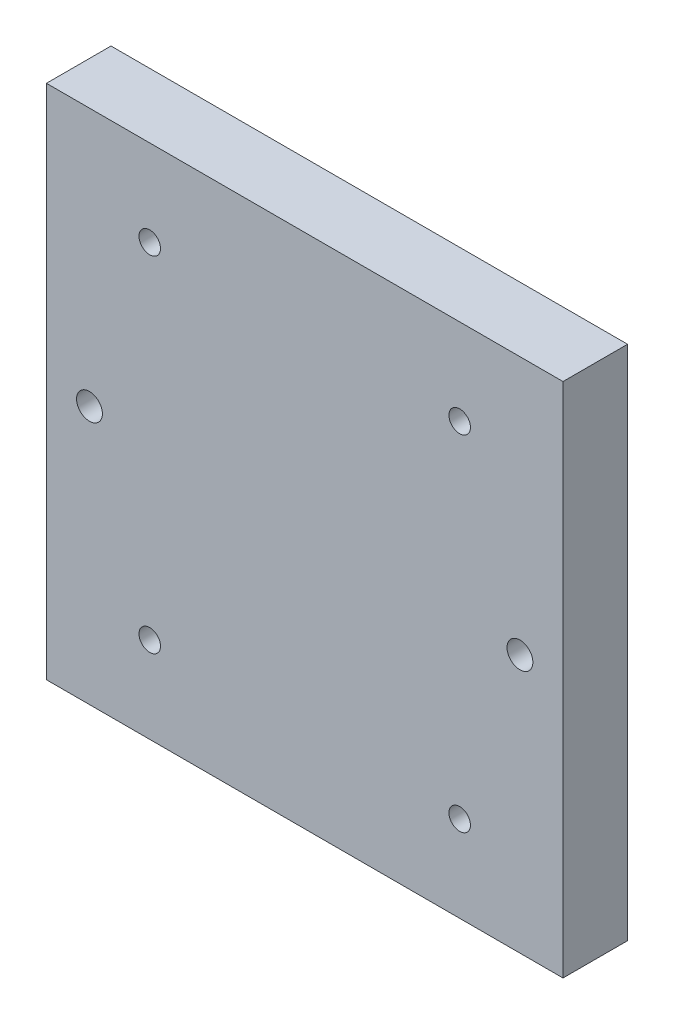
ISO-10303-21;
HEADER;
FILE_DESCRIPTION(('STEP AP214'),'2;1');
FILE_NAME('part.step','',(''),(''),'','','');
FILE_SCHEMA(('AUTOMOTIVE_DESIGN { 1 0 10303 214 1 1 1 1 }'));
ENDSEC;
DATA;
#1=APPLICATION_CONTEXT('core data for automotive mechanical design processes');
#2=APPLICATION_PROTOCOL_DEFINITION('international standard','automotive_design',2000,#1);
#3=PRODUCT_CONTEXT('',#1,'mechanical');
#4=PRODUCT('Part','Part','',(#3));
#5=PRODUCT_RELATED_PRODUCT_CATEGORY('part','',(#4));
#6=PRODUCT_DEFINITION_FORMATION('','',#4);
#7=PRODUCT_DEFINITION_CONTEXT('part definition',#1,'design');
#8=PRODUCT_DEFINITION('design','',#6,#7);
#9=PRODUCT_DEFINITION_SHAPE('','',#8);
#10=(LENGTH_UNIT() NAMED_UNIT(*) SI_UNIT(.MILLI.,.METRE.));
#11=(NAMED_UNIT(*) PLANE_ANGLE_UNIT() SI_UNIT($,.RADIAN.));
#12=(NAMED_UNIT(*) SI_UNIT($,.STERADIAN.) SOLID_ANGLE_UNIT());
#13=UNCERTAINTY_MEASURE_WITH_UNIT(LENGTH_MEASURE(1.E-05),#10,'distance_accuracy_value','');
#14=(GEOMETRIC_REPRESENTATION_CONTEXT(3) GLOBAL_UNCERTAINTY_ASSIGNED_CONTEXT((#13)) GLOBAL_UNIT_ASSIGNED_CONTEXT((#10,
#11,#12)) REPRESENTATION_CONTEXT('',''));
#15=CARTESIAN_POINT('',(0.,0.,0.));
#16=DIRECTION('',(0.,0.,1.));
#17=DIRECTION('',(1.,0.,0.));
#18=AXIS2_PLACEMENT_3D('',#15,#16,#17);
#19=CARTESIAN_POINT('',(60.,60.,-15.));
#20=DIRECTION('',(1.,0.,0.));
#21=DIRECTION('',(0.,1.,0.));
#22=AXIS2_PLACEMENT_3D('',#19,#20,#21);
#23=PLANE('',#22);
#24=DIRECTION('',(0.,1.,0.));
#25=VECTOR('',#24,1.);
#26=CARTESIAN_POINT('',(60.,60.,0.));
#27=LINE('',#26,#25);
#28=CARTESIAN_POINT('',(60.,-60.,0.));
#29=VERTEX_POINT('',#28);
#30=CARTESIAN_POINT('',(60.,60.,0.));
#31=VERTEX_POINT('',#30);
#32=EDGE_CURVE('E110',#29,#31,#27,.T.);
#33=ORIENTED_EDGE('',*,*,#32,.F.);
#34=DIRECTION('',(0.,0.,1.));
#35=VECTOR('',#34,1.);
#36=CARTESIAN_POINT('',(60.,-60.,-15.));
#37=LINE('',#36,#35);
#38=CARTESIAN_POINT('',(60.,-60.,-15.));
#39=VERTEX_POINT('',#38);
#40=EDGE_CURVE('E11',#39,#29,#37,.T.);
#41=ORIENTED_EDGE('',*,*,#40,.F.);
#42=DIRECTION('',(0.,1.,0.));
#43=VECTOR('',#42,1.);
#44=CARTESIAN_POINT('',(60.,60.,-15.));
#45=LINE('',#44,#43);
#46=CARTESIAN_POINT('',(60.,60.,-15.));
#47=VERTEX_POINT('',#46);
#48=EDGE_CURVE('E101',#39,#47,#45,.T.);
#49=ORIENTED_EDGE('',*,*,#48,.T.);
#50=DIRECTION('',(0.,0.,1.));
#51=VECTOR('',#50,1.);
#52=CARTESIAN_POINT('',(60.,60.,-15.));
#53=LINE('',#52,#51);
#54=EDGE_CURVE('E42',#47,#31,#53,.T.);
#55=ORIENTED_EDGE('',*,*,#54,.T.);
#56=EDGE_LOOP('',(#33,#41,#49,#55));
#57=FACE_BOUND('',#56,.T.);
#58=ADVANCED_FACE('F39',(#57),#23,.T.);
#59=CARTESIAN_POINT('',(-60.,-60.,-15.));
#60=DIRECTION('',(0.,-1.,0.));
#61=DIRECTION('',(0.,0.,-1.));
#62=AXIS2_PLACEMENT_3D('',#59,#60,#61);
#63=PLANE('',#62);
#64=DIRECTION('',(1.,0.,0.));
#65=VECTOR('',#64,1.);
#66=CARTESIAN_POINT('',(-60.,-60.,0.));
#67=LINE('',#66,#65);
#68=CARTESIAN_POINT('',(-60.,-60.,0.));
#69=VERTEX_POINT('',#68);
#70=EDGE_CURVE('E104',#69,#29,#67,.T.);
#71=ORIENTED_EDGE('',*,*,#70,.F.);
#72=DIRECTION('',(0.,0.,1.));
#73=VECTOR('',#72,1.);
#74=CARTESIAN_POINT('',(-60.,-60.,-15.));
#75=LINE('',#74,#73);
#76=CARTESIAN_POINT('',(-60.,-60.,-15.));
#77=VERTEX_POINT('',#76);
#78=EDGE_CURVE('E49',#77,#69,#75,.T.);
#79=ORIENTED_EDGE('',*,*,#78,.F.);
#80=DIRECTION('',(1.,0.,0.));
#81=VECTOR('',#80,1.);
#82=CARTESIAN_POINT('',(-60.,-60.,-15.));
#83=LINE('',#82,#81);
#84=EDGE_CURVE('E96',#77,#39,#83,.T.);
#85=ORIENTED_EDGE('',*,*,#84,.T.);
#86=ORIENTED_EDGE('',*,*,#40,.T.);
#87=EDGE_LOOP('',(#71,#79,#85,#86));
#88=FACE_BOUND('',#87,.T.);
#89=ADVANCED_FACE('F127',(#88),#63,.T.);
#90=CARTESIAN_POINT('',(-60.,60.,-15.));
#91=DIRECTION('',(-1.,0.,0.));
#92=DIRECTION('',(0.,-1.,0.));
#93=AXIS2_PLACEMENT_3D('',#90,#91,#92);
#94=PLANE('',#93);
#95=DIRECTION('',(0.,-1.,0.));
#96=VECTOR('',#95,1.);
#97=CARTESIAN_POINT('',(-60.,60.,0.));
#98=LINE('',#97,#96);
#99=CARTESIAN_POINT('',(-60.,60.,0.));
#100=VERTEX_POINT('',#99);
#101=EDGE_CURVE('E90',#100,#69,#98,.T.);
#102=ORIENTED_EDGE('',*,*,#101,.F.);
#103=DIRECTION('',(0.,0.,1.));
#104=VECTOR('',#103,1.);
#105=CARTESIAN_POINT('',(-60.,60.,-15.));
#106=LINE('',#105,#104);
#107=CARTESIAN_POINT('',(-60.,60.,-15.));
#108=VERTEX_POINT('',#107);
#109=EDGE_CURVE('E85',#108,#100,#106,.T.);
#110=ORIENTED_EDGE('',*,*,#109,.F.);
#111=DIRECTION('',(0.,-1.,0.));
#112=VECTOR('',#111,1.);
#113=CARTESIAN_POINT('',(-60.,60.,-15.));
#114=LINE('',#113,#112);
#115=EDGE_CURVE('E88',#108,#77,#114,.T.);
#116=ORIENTED_EDGE('',*,*,#115,.T.);
#117=ORIENTED_EDGE('',*,*,#78,.T.);
#118=EDGE_LOOP('',(#102,#110,#116,#117));
#119=FACE_BOUND('',#118,.T.);
#120=ADVANCED_FACE('F87',(#119),#94,.T.);
#121=CARTESIAN_POINT('',(-60.,60.,-15.));
#122=DIRECTION('',(0.,1.,0.));
#123=DIRECTION('',(0.,0.,1.));
#124=AXIS2_PLACEMENT_3D('',#121,#122,#123);
#125=PLANE('',#124);
#126=DIRECTION('',(-1.,0.,0.));
#127=VECTOR('',#126,1.);
#128=CARTESIAN_POINT('',(-60.,60.,0.));
#129=LINE('',#128,#127);
#130=EDGE_CURVE('E114',#31,#100,#129,.T.);
#131=ORIENTED_EDGE('',*,*,#130,.F.);
#132=ORIENTED_EDGE('',*,*,#54,.F.);
#133=DIRECTION('',(-1.,0.,0.));
#134=VECTOR('',#133,1.);
#135=CARTESIAN_POINT('',(-60.,60.,-15.));
#136=LINE('',#135,#134);
#137=EDGE_CURVE('E95',#47,#108,#136,.T.);
#138=ORIENTED_EDGE('',*,*,#137,.T.);
#139=ORIENTED_EDGE('',*,*,#109,.T.);
#140=EDGE_LOOP('',(#131,#132,#138,#139));
#141=FACE_BOUND('',#140,.T.);
#142=ADVANCED_FACE('F99',(#141),#125,.T.);
#143=CARTESIAN_POINT('',(0.,0.,-15.));
#144=DIRECTION('',(0.,0.,1.));
#145=DIRECTION('',(1.,0.,0.));
#146=AXIS2_PLACEMENT_3D('',#143,#144,#145);
#147=PLANE('',#146);
#148=CARTESIAN_POINT('',(-50.,0.,-15.));
#149=DIRECTION('',(0.,0.,-1.));
#150=DIRECTION('',(-1.,0.,0.));
#151=AXIS2_PLACEMENT_3D('',#148,#149,#150);
#152=CIRCLE('',#151,3.);
#153=CARTESIAN_POINT('',(-53.,0.,-15.));
#154=VERTEX_POINT('',#153);
#155=EDGE_CURVE('E115',#154,#154,#152,.T.);
#156=ORIENTED_EDGE('',*,*,#155,.F.);
#157=EDGE_LOOP('',(#156));
#158=FACE_BOUND('',#157,.T.);
#159=CARTESIAN_POINT('',(-36.,40.,-15.));
#160=DIRECTION('',(0.,0.,-1.));
#161=DIRECTION('',(-1.,0.,0.));
#162=AXIS2_PLACEMENT_3D('',#159,#160,#161);
#163=CIRCLE('',#162,2.5);
#164=CARTESIAN_POINT('',(-38.5,40.,-15.));
#165=VERTEX_POINT('',#164);
#166=EDGE_CURVE('E185',#165,#165,#163,.T.);
#167=ORIENTED_EDGE('',*,*,#166,.F.);
#168=EDGE_LOOP('',(#167));
#169=FACE_BOUND('',#168,.T.);
#170=CARTESIAN_POINT('',(50.,0.,-15.));
#171=DIRECTION('',(0.,0.,-1.));
#172=DIRECTION('',(1.,0.,0.));
#173=AXIS2_PLACEMENT_3D('',#170,#171,#172);
#174=CIRCLE('',#173,3.);
#175=CARTESIAN_POINT('',(53.,0.,-15.));
#176=VERTEX_POINT('',#175);
#177=EDGE_CURVE('E182',#176,#176,#174,.T.);
#178=ORIENTED_EDGE('',*,*,#177,.F.);
#179=EDGE_LOOP('',(#178));
#180=FACE_BOUND('',#179,.T.);
#181=CARTESIAN_POINT('',(36.,-40.,-15.));
#182=DIRECTION('',(0.,0.,-1.));
#183=DIRECTION('',(-1.,0.,0.));
#184=AXIS2_PLACEMENT_3D('',#181,#182,#183);
#185=CIRCLE('',#184,2.5);
#186=CARTESIAN_POINT('',(33.5,-40.,-15.));
#187=VERTEX_POINT('',#186);
#188=EDGE_CURVE('E217',#187,#187,#185,.T.);
#189=ORIENTED_EDGE('',*,*,#188,.F.);
#190=EDGE_LOOP('',(#189));
#191=FACE_BOUND('',#190,.T.);
#192=CARTESIAN_POINT('',(36.,40.,-15.));
#193=DIRECTION('',(0.,0.,-1.));
#194=DIRECTION('',(1.,0.,0.));
#195=AXIS2_PLACEMENT_3D('',#192,#193,#194);
#196=CIRCLE('',#195,2.5);
#197=CARTESIAN_POINT('',(38.5,40.,-15.));
#198=VERTEX_POINT('',#197);
#199=EDGE_CURVE('E194',#198,#198,#196,.T.);
#200=ORIENTED_EDGE('',*,*,#199,.F.);
#201=EDGE_LOOP('',(#200));
#202=FACE_BOUND('',#201,.T.);
#203=CARTESIAN_POINT('',(-36.,-40.,-15.));
#204=DIRECTION('',(0.,0.,-1.));
#205=DIRECTION('',(1.,0.,0.));
#206=AXIS2_PLACEMENT_3D('',#203,#204,#205);
#207=CIRCLE('',#206,2.5);
#208=CARTESIAN_POINT('',(-33.5,-40.,-15.));
#209=VERTEX_POINT('',#208);
#210=EDGE_CURVE('E203',#209,#209,#207,.T.);
#211=ORIENTED_EDGE('',*,*,#210,.F.);
#212=EDGE_LOOP('',(#211));
#213=FACE_BOUND('',#212,.T.);
#214=ORIENTED_EDGE('',*,*,#48,.F.);
#215=ORIENTED_EDGE('',*,*,#84,.F.);
#216=ORIENTED_EDGE('',*,*,#115,.F.);
#217=ORIENTED_EDGE('',*,*,#137,.F.);
#218=EDGE_LOOP('',(#214,#215,#216,#217));
#219=FACE_BOUND('',#218,.T.);
#220=ADVANCED_FACE('F94',(#158,#169,#180,#191,#202,#213,#219),#147,.F.);
#221=CARTESIAN_POINT('',(0.,0.,0.));
#222=DIRECTION('',(0.,0.,1.));
#223=DIRECTION('',(1.,0.,0.));
#224=AXIS2_PLACEMENT_3D('',#221,#222,#223);
#225=PLANE('',#224);
#226=CARTESIAN_POINT('',(-50.,0.,0.));
#227=DIRECTION('',(0.,0.,1.));
#228=DIRECTION('',(1.,0.,0.));
#229=AXIS2_PLACEMENT_3D('',#226,#227,#228);
#230=CIRCLE('',#229,3.);
#231=CARTESIAN_POINT('',(-47.,0.,0.));
#232=VERTEX_POINT('',#231);
#233=EDGE_CURVE('E177',#232,#232,#230,.F.);
#234=ORIENTED_EDGE('',*,*,#233,.T.);
#235=EDGE_LOOP('',(#234));
#236=FACE_BOUND('',#235,.T.);
#237=CARTESIAN_POINT('',(-36.,40.,0.));
#238=DIRECTION('',(0.,0.,1.));
#239=DIRECTION('',(1.,0.,0.));
#240=AXIS2_PLACEMENT_3D('',#237,#238,#239);
#241=CIRCLE('',#240,2.5);
#242=CARTESIAN_POINT('',(-33.5,40.,0.));
#243=VERTEX_POINT('',#242);
#244=EDGE_CURVE('E190',#243,#243,#241,.F.);
#245=ORIENTED_EDGE('',*,*,#244,.T.);
#246=EDGE_LOOP('',(#245));
#247=FACE_BOUND('',#246,.T.);
#248=CARTESIAN_POINT('',(50.,0.,0.));
#249=DIRECTION('',(0.,0.,1.));
#250=DIRECTION('',(1.,0.,0.));
#251=AXIS2_PLACEMENT_3D('',#248,#249,#250);
#252=CIRCLE('',#251,3.);
#253=CARTESIAN_POINT('',(53.,0.,0.));
#254=VERTEX_POINT('',#253);
#255=EDGE_CURVE('E213',#254,#254,#252,.F.);
#256=ORIENTED_EDGE('',*,*,#255,.T.);
#257=EDGE_LOOP('',(#256));
#258=FACE_BOUND('',#257,.T.);
#259=CARTESIAN_POINT('',(36.,-40.,0.));
#260=DIRECTION('',(0.,0.,1.));
#261=DIRECTION('',(1.,0.,0.));
#262=AXIS2_PLACEMENT_3D('',#259,#260,#261);
#263=CIRCLE('',#262,2.5);
#264=CARTESIAN_POINT('',(38.5,-40.,0.));
#265=VERTEX_POINT('',#264);
#266=EDGE_CURVE('E198',#265,#265,#263,.F.);
#267=ORIENTED_EDGE('',*,*,#266,.T.);
#268=EDGE_LOOP('',(#267));
#269=FACE_BOUND('',#268,.T.);
#270=CARTESIAN_POINT('',(36.,40.,0.));
#271=DIRECTION('',(0.,0.,1.));
#272=DIRECTION('',(1.,0.,0.));
#273=AXIS2_PLACEMENT_3D('',#270,#271,#272);
#274=CIRCLE('',#273,2.5);
#275=CARTESIAN_POINT('',(38.5,40.,0.));
#276=VERTEX_POINT('',#275);
#277=EDGE_CURVE('E199',#276,#276,#274,.F.);
#278=ORIENTED_EDGE('',*,*,#277,.T.);
#279=EDGE_LOOP('',(#278));
#280=FACE_BOUND('',#279,.T.);
#281=CARTESIAN_POINT('',(-36.,-40.,0.));
#282=DIRECTION('',(0.,0.,1.));
#283=DIRECTION('',(1.,0.,0.));
#284=AXIS2_PLACEMENT_3D('',#281,#282,#283);
#285=CIRCLE('',#284,2.5);
#286=CARTESIAN_POINT('',(-33.5,-40.,0.));
#287=VERTEX_POINT('',#286);
#288=EDGE_CURVE('E189',#287,#287,#285,.F.);
#289=ORIENTED_EDGE('',*,*,#288,.T.);
#290=EDGE_LOOP('',(#289));
#291=FACE_BOUND('',#290,.T.);
#292=ORIENTED_EDGE('',*,*,#32,.T.);
#293=ORIENTED_EDGE('',*,*,#130,.T.);
#294=ORIENTED_EDGE('',*,*,#101,.T.);
#295=ORIENTED_EDGE('',*,*,#70,.T.);
#296=EDGE_LOOP('',(#292,#293,#294,#295));
#297=FACE_BOUND('',#296,.T.);
#298=ADVANCED_FACE('F126',(#236,#247,#258,#269,#280,#291,#297),#225,.T.);
#299=CARTESIAN_POINT('',(-36.,-40.,0.000999999999999265));
#300=DIRECTION('',(0.,0.,-1.));
#301=DIRECTION('',(-1.,0.,0.));
#302=AXIS2_PLACEMENT_3D('',#299,#300,#301);
#303=CYLINDRICAL_SURFACE('',#302,2.5);
#304=ORIENTED_EDGE('',*,*,#288,.F.);
#305=EDGE_LOOP('',(#304));
#306=FACE_BOUND('',#305,.T.);
#307=ORIENTED_EDGE('',*,*,#210,.T.);
#308=EDGE_LOOP('',(#307));
#309=FACE_BOUND('',#308,.T.);
#310=ADVANCED_FACE('F145',(#306,#309),#303,.F.);
#311=CARTESIAN_POINT('',(36.,40.,0.000999999999999265));
#312=DIRECTION('',(0.,0.,-1.));
#313=DIRECTION('',(-1.,0.,0.));
#314=AXIS2_PLACEMENT_3D('',#311,#312,#313);
#315=CYLINDRICAL_SURFACE('',#314,2.5);
#316=ORIENTED_EDGE('',*,*,#277,.F.);
#317=EDGE_LOOP('',(#316));
#318=FACE_BOUND('',#317,.T.);
#319=ORIENTED_EDGE('',*,*,#199,.T.);
#320=EDGE_LOOP('',(#319));
#321=FACE_BOUND('',#320,.T.);
#322=ADVANCED_FACE('F154',(#318,#321),#315,.F.);
#323=CARTESIAN_POINT('',(36.,-40.,0.000999999999999265));
#324=DIRECTION('',(0.,0.,-1.));
#325=DIRECTION('',(-1.,0.,0.));
#326=AXIS2_PLACEMENT_3D('',#323,#324,#325);
#327=CYLINDRICAL_SURFACE('',#326,2.5);
#328=ORIENTED_EDGE('',*,*,#266,.F.);
#329=EDGE_LOOP('',(#328));
#330=FACE_BOUND('',#329,.T.);
#331=ORIENTED_EDGE('',*,*,#188,.T.);
#332=EDGE_LOOP('',(#331));
#333=FACE_BOUND('',#332,.T.);
#334=ADVANCED_FACE('F150',(#330,#333),#327,.F.);
#335=CARTESIAN_POINT('',(50.,0.,0.000999999999999265));
#336=DIRECTION('',(0.,0.,-1.));
#337=DIRECTION('',(-1.,0.,0.));
#338=AXIS2_PLACEMENT_3D('',#335,#336,#337);
#339=CYLINDRICAL_SURFACE('',#338,3.);
#340=ORIENTED_EDGE('',*,*,#255,.F.);
#341=EDGE_LOOP('',(#340));
#342=FACE_BOUND('',#341,.T.);
#343=ORIENTED_EDGE('',*,*,#177,.T.);
#344=EDGE_LOOP('',(#343));
#345=FACE_BOUND('',#344,.T.);
#346=ADVANCED_FACE('F153',(#342,#345),#339,.F.);
#347=CARTESIAN_POINT('',(-36.,40.,0.000999999999999265));
#348=DIRECTION('',(0.,0.,-1.));
#349=DIRECTION('',(-1.,0.,0.));
#350=AXIS2_PLACEMENT_3D('',#347,#348,#349);
#351=CYLINDRICAL_SURFACE('',#350,2.5);
#352=ORIENTED_EDGE('',*,*,#244,.F.);
#353=EDGE_LOOP('',(#352));
#354=FACE_BOUND('',#353,.T.);
#355=ORIENTED_EDGE('',*,*,#166,.T.);
#356=EDGE_LOOP('',(#355));
#357=FACE_BOUND('',#356,.T.);
#358=ADVANCED_FACE('F158',(#354,#357),#351,.F.);
#359=CARTESIAN_POINT('',(-50.,0.,0.000999999999999265));
#360=DIRECTION('',(0.,0.,-1.));
#361=DIRECTION('',(-1.,0.,0.));
#362=AXIS2_PLACEMENT_3D('',#359,#360,#361);
#363=CYLINDRICAL_SURFACE('',#362,3.);
#364=ORIENTED_EDGE('',*,*,#233,.F.);
#365=EDGE_LOOP('',(#364));
#366=FACE_BOUND('',#365,.T.);
#367=ORIENTED_EDGE('',*,*,#155,.T.);
#368=EDGE_LOOP('',(#367));
#369=FACE_BOUND('',#368,.T.);
#370=ADVANCED_FACE('F168',(#366,#369),#363,.F.);
#371=CLOSED_SHELL('',(#58,#89,#120,#142,#220,#298,#310,#322,#334,#346,#358,#370));
#372=MANIFOLD_SOLID_BREP('B2',#371);
#373=ADVANCED_BREP_SHAPE_REPRESENTATION('',(#18,#372),#14);
#374=SHAPE_DEFINITION_REPRESENTATION(#9,#373);
ENDSEC;
END-ISO-10303-21;
